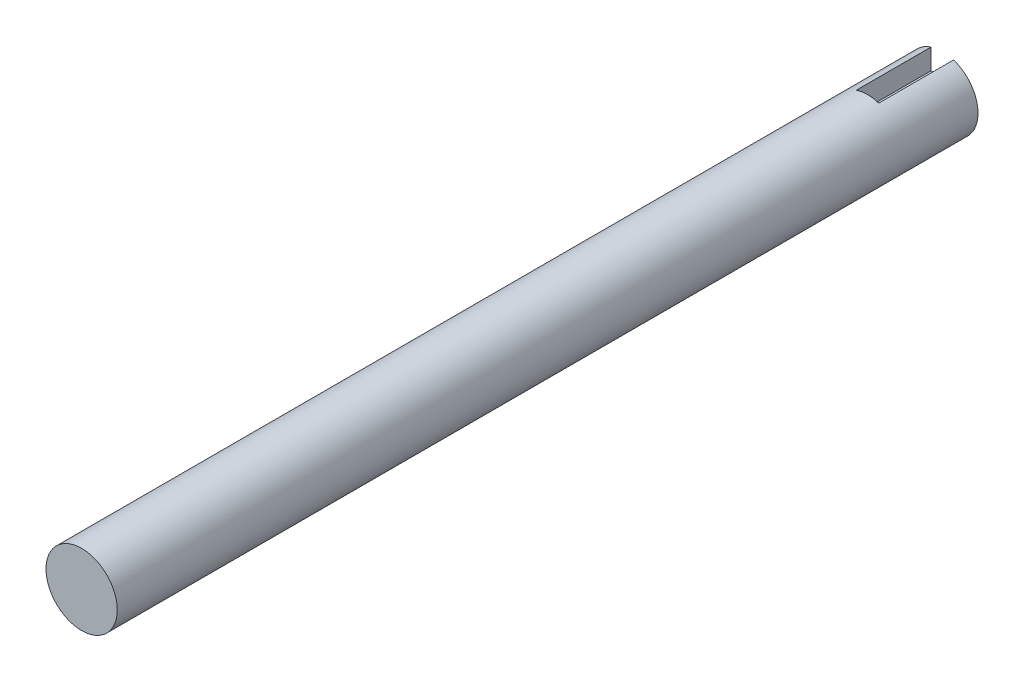
ISO-10303-21;
HEADER;
FILE_DESCRIPTION(('STEP AP214'),'2;1');
FILE_NAME('part.step','',(''),(''),'','','');
FILE_SCHEMA(('AUTOMOTIVE_DESIGN { 1 0 10303 214 1 1 1 1 }'));
ENDSEC;
DATA;
#1=APPLICATION_CONTEXT('core data for automotive mechanical design processes');
#2=APPLICATION_PROTOCOL_DEFINITION('international standard','automotive_design',2000,#1);
#3=PRODUCT_CONTEXT('',#1,'mechanical');
#4=PRODUCT('Part','Part','',(#3));
#5=PRODUCT_RELATED_PRODUCT_CATEGORY('part','',(#4));
#6=PRODUCT_DEFINITION_FORMATION('','',#4);
#7=PRODUCT_DEFINITION_CONTEXT('part definition',#1,'design');
#8=PRODUCT_DEFINITION('design','',#6,#7);
#9=PRODUCT_DEFINITION_SHAPE('','',#8);
#10=(LENGTH_UNIT() NAMED_UNIT(*) SI_UNIT(.MILLI.,.METRE.));
#11=(NAMED_UNIT(*) PLANE_ANGLE_UNIT() SI_UNIT($,.RADIAN.));
#12=(NAMED_UNIT(*) SI_UNIT($,.STERADIAN.) SOLID_ANGLE_UNIT());
#13=UNCERTAINTY_MEASURE_WITH_UNIT(LENGTH_MEASURE(1.E-05),#10,'distance_accuracy_value','');
#14=(GEOMETRIC_REPRESENTATION_CONTEXT(3) GLOBAL_UNCERTAINTY_ASSIGNED_CONTEXT((#13)) GLOBAL_UNIT_ASSIGNED_CONTEXT((#10,
#11,#12)) REPRESENTATION_CONTEXT('',''));
#15=CARTESIAN_POINT('',(0.,0.,0.));
#16=DIRECTION('',(0.,0.,1.));
#17=DIRECTION('',(1.,0.,0.));
#18=AXIS2_PLACEMENT_3D('',#15,#16,#17);
#19=CARTESIAN_POINT('',(0.,0.,115.));
#20=DIRECTION('',(0.,0.,-1.));
#21=DIRECTION('',(-1.,0.,0.));
#22=AXIS2_PLACEMENT_3D('',#19,#20,#21);
#23=CYLINDRICAL_SURFACE('',#22,4.7625);
#24=CARTESIAN_POINT('',(0.,0.,115.));
#25=DIRECTION('',(0.,0.,1.));
#26=DIRECTION('',(1.,0.,0.));
#27=AXIS2_PLACEMENT_3D('',#24,#25,#26);
#28=CIRCLE('',#27,4.7625);
#29=CARTESIAN_POINT('',(4.7625,0.,115.));
#30=VERTEX_POINT('',#29);
#31=EDGE_CURVE('E11',#30,#30,#28,.T.);
#32=ORIENTED_EDGE('',*,*,#31,.F.);
#33=EDGE_LOOP('',(#32));
#34=FACE_BOUND('',#33,.T.);
#35=CARTESIAN_POINT('',(0.,0.,0.));
#36=DIRECTION('',(0.,0.,1.));
#37=DIRECTION('',(1.,0.,0.));
#38=AXIS2_PLACEMENT_3D('',#35,#36,#37);
#39=CIRCLE('',#38,4.7625);
#40=CARTESIAN_POINT('',(-1.5,4.52011130947015,0.));
#41=VERTEX_POINT('',#40);
#42=CARTESIAN_POINT('',(1.5,4.52011130947016,0.));
#43=VERTEX_POINT('',#42);
#44=EDGE_CURVE('E50',#41,#43,#39,.T.);
#45=ORIENTED_EDGE('',*,*,#44,.T.);
#46=DIRECTION('',(0.,0.,-1.));
#47=VECTOR('',#46,1.);
#48=CARTESIAN_POINT('',(1.5,4.52011130947016,10.));
#49=LINE('',#48,#47);
#50=CARTESIAN_POINT('',(1.5,4.52011130947016,10.));
#51=VERTEX_POINT('',#50);
#52=EDGE_CURVE('E105',#51,#43,#49,.T.);
#53=ORIENTED_EDGE('',*,*,#52,.F.);
#54=CARTESIAN_POINT('',(0.,0.,10.));
#55=DIRECTION('',(0.,0.,1.));
#56=DIRECTION('',(1.,0.,0.));
#57=AXIS2_PLACEMENT_3D('',#54,#55,#56);
#58=CIRCLE('',#57,4.7625);
#59=CARTESIAN_POINT('',(-1.5,4.52011130947015,10.));
#60=VERTEX_POINT('',#59);
#61=EDGE_CURVE('E92',#51,#60,#58,.T.);
#62=ORIENTED_EDGE('',*,*,#61,.T.);
#63=DIRECTION('',(0.,0.,-1.));
#64=VECTOR('',#63,1.);
#65=CARTESIAN_POINT('',(-1.5,4.52011130947015,10.));
#66=LINE('',#65,#64);
#67=EDGE_CURVE('E96',#60,#41,#66,.T.);
#68=ORIENTED_EDGE('',*,*,#67,.T.);
#69=EDGE_LOOP('',(#45,#53,#62,#68));
#70=FACE_BOUND('',#69,.T.);
#71=ADVANCED_FACE('F47',(#34,#70),#23,.T.);
#72=CARTESIAN_POINT('',(0.,0.,115.));
#73=DIRECTION('',(0.,0.,1.));
#74=DIRECTION('',(1.,0.,0.));
#75=AXIS2_PLACEMENT_3D('',#72,#73,#74);
#76=PLANE('',#75);
#77=ORIENTED_EDGE('',*,*,#31,.T.);
#78=EDGE_LOOP('',(#77));
#79=FACE_BOUND('',#78,.T.);
#80=ADVANCED_FACE('F145',(#79),#76,.T.);
#81=CARTESIAN_POINT('',(0.,0.,0.));
#82=DIRECTION('',(0.,0.,1.));
#83=DIRECTION('',(1.,0.,0.));
#84=AXIS2_PLACEMENT_3D('',#81,#82,#83);
#85=PLANE('',#84);
#86=DIRECTION('',(1.,0.,0.));
#87=VECTOR('',#86,1.);
#88=CARTESIAN_POINT('',(0.,1.7625,0.));
#89=LINE('',#88,#87);
#90=CARTESIAN_POINT('',(-1.5,1.7625,0.));
#91=VERTEX_POINT('',#90);
#92=CARTESIAN_POINT('',(1.5,1.7625,0.));
#93=VERTEX_POINT('',#92);
#94=EDGE_CURVE('E115',#91,#93,#89,.T.);
#95=ORIENTED_EDGE('',*,*,#94,.T.);
#96=DIRECTION('',(0.,-1.,0.));
#97=VECTOR('',#96,1.);
#98=CARTESIAN_POINT('',(1.5,0.,0.));
#99=LINE('',#98,#97);
#100=EDGE_CURVE('E62',#43,#93,#99,.T.);
#101=ORIENTED_EDGE('',*,*,#100,.F.);
#102=ORIENTED_EDGE('',*,*,#44,.F.);
#103=DIRECTION('',(0.,-1.,0.));
#104=VECTOR('',#103,1.);
#105=CARTESIAN_POINT('',(-1.5,0.,0.));
#106=LINE('',#105,#104);
#107=EDGE_CURVE('E100',#41,#91,#106,.T.);
#108=ORIENTED_EDGE('',*,*,#107,.T.);
#109=EDGE_LOOP('',(#95,#101,#102,#108));
#110=FACE_BOUND('',#109,.T.);
#111=ADVANCED_FACE('F135',(#110),#85,.F.);
#112=CARTESIAN_POINT('',(1.5,0.,10.));
#113=DIRECTION('',(1.,0.,0.));
#114=DIRECTION('',(0.,1.,0.));
#115=AXIS2_PLACEMENT_3D('',#112,#113,#114);
#116=PLANE('',#115);
#117=ORIENTED_EDGE('',*,*,#100,.T.);
#118=DIRECTION('',(0.,0.,-1.));
#119=VECTOR('',#118,1.);
#120=CARTESIAN_POINT('',(1.5,1.7625,10.));
#121=LINE('',#120,#119);
#122=CARTESIAN_POINT('',(1.5,1.7625,10.));
#123=VERTEX_POINT('',#122);
#124=EDGE_CURVE('E120',#123,#93,#121,.T.);
#125=ORIENTED_EDGE('',*,*,#124,.F.);
#126=DIRECTION('',(0.,-1.,0.));
#127=VECTOR('',#126,1.);
#128=CARTESIAN_POINT('',(1.5,0.,10.));
#129=LINE('',#128,#127);
#130=EDGE_CURVE('E112',#51,#123,#129,.T.);
#131=ORIENTED_EDGE('',*,*,#130,.F.);
#132=ORIENTED_EDGE('',*,*,#52,.T.);
#133=EDGE_LOOP('',(#117,#125,#131,#132));
#134=FACE_BOUND('',#133,.T.);
#135=ADVANCED_FACE('F137',(#134),#116,.F.);
#136=CARTESIAN_POINT('',(-1.5,0.,10.));
#137=DIRECTION('',(1.,0.,0.));
#138=DIRECTION('',(0.,1.,0.));
#139=AXIS2_PLACEMENT_3D('',#136,#137,#138);
#140=PLANE('',#139);
#141=ORIENTED_EDGE('',*,*,#107,.F.);
#142=ORIENTED_EDGE('',*,*,#67,.F.);
#143=DIRECTION('',(0.,-1.,0.));
#144=VECTOR('',#143,1.);
#145=CARTESIAN_POINT('',(-1.5,0.,10.));
#146=LINE('',#145,#144);
#147=CARTESIAN_POINT('',(-1.5,1.7625,10.));
#148=VERTEX_POINT('',#147);
#149=EDGE_CURVE('E98',#60,#148,#146,.T.);
#150=ORIENTED_EDGE('',*,*,#149,.T.);
#151=DIRECTION('',(0.,0.,-1.));
#152=VECTOR('',#151,1.);
#153=CARTESIAN_POINT('',(-1.5,1.7625,10.));
#154=LINE('',#153,#152);
#155=EDGE_CURVE('E84',#148,#91,#154,.T.);
#156=ORIENTED_EDGE('',*,*,#155,.T.);
#157=EDGE_LOOP('',(#141,#142,#150,#156));
#158=FACE_BOUND('',#157,.T.);
#159=ADVANCED_FACE('F97',(#158),#140,.T.);
#160=CARTESIAN_POINT('',(0.,1.7625,10.));
#161=DIRECTION('',(0.,1.,0.));
#162=DIRECTION('',(0.,0.,1.));
#163=AXIS2_PLACEMENT_3D('',#160,#161,#162);
#164=PLANE('',#163);
#165=ORIENTED_EDGE('',*,*,#94,.F.);
#166=ORIENTED_EDGE('',*,*,#155,.F.);
#167=DIRECTION('',(1.,0.,0.));
#168=VECTOR('',#167,1.);
#169=CARTESIAN_POINT('',(0.,1.7625,10.));
#170=LINE('',#169,#168);
#171=EDGE_CURVE('E70',#148,#123,#170,.T.);
#172=ORIENTED_EDGE('',*,*,#171,.T.);
#173=ORIENTED_EDGE('',*,*,#124,.T.);
#174=EDGE_LOOP('',(#165,#166,#172,#173));
#175=FACE_BOUND('',#174,.T.);
#176=ADVANCED_FACE('F136',(#175),#164,.T.);
#177=CARTESIAN_POINT('',(0.,0.,10.));
#178=DIRECTION('',(0.,0.,1.));
#179=DIRECTION('',(1.,0.,0.));
#180=AXIS2_PLACEMENT_3D('',#177,#178,#179);
#181=PLANE('',#180);
#182=ORIENTED_EDGE('',*,*,#130,.T.);
#183=ORIENTED_EDGE('',*,*,#171,.F.);
#184=ORIENTED_EDGE('',*,*,#149,.F.);
#185=ORIENTED_EDGE('',*,*,#61,.F.);
#186=EDGE_LOOP('',(#182,#183,#184,#185));
#187=FACE_BOUND('',#186,.T.);
#188=ADVANCED_FACE('F107',(#187),#181,.F.);
#189=CLOSED_SHELL('',(#71,#80,#111,#135,#159,#176,#188));
#190=MANIFOLD_SOLID_BREP('B2',#189);
#191=ADVANCED_BREP_SHAPE_REPRESENTATION('',(#18,#190),#14);
#192=SHAPE_DEFINITION_REPRESENTATION(#9,#191);
ENDSEC;
END-ISO-10303-21;
